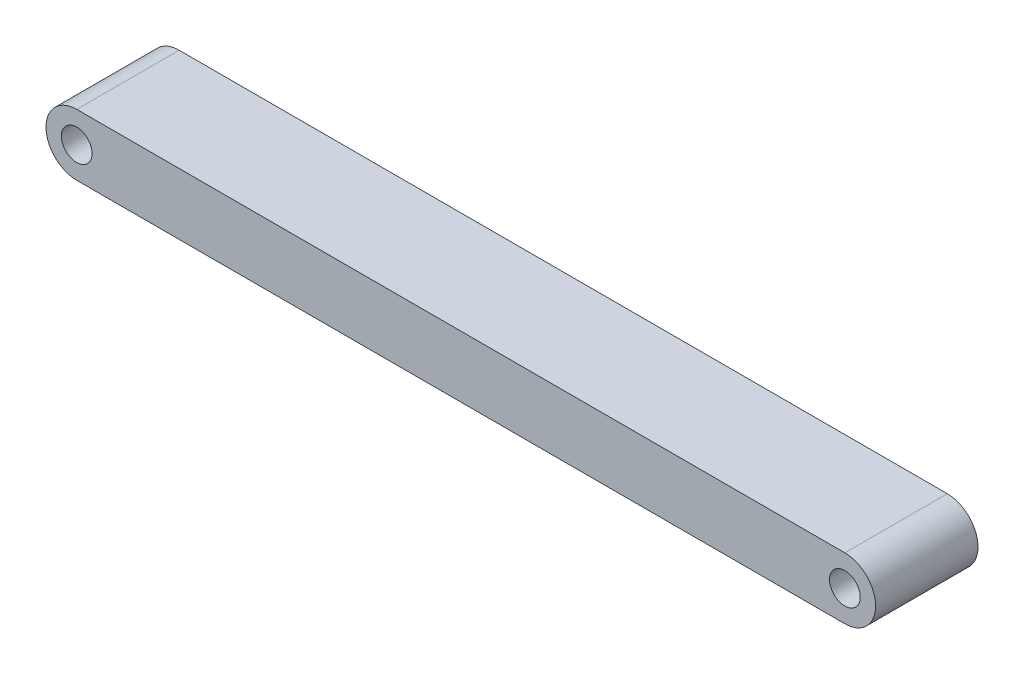
ISO-10303-21;
HEADER;
FILE_DESCRIPTION(('STEP AP214'),'2;1');
FILE_NAME('part.step','',(''),(''),'','','');
FILE_SCHEMA(('AUTOMOTIVE_DESIGN { 1 0 10303 214 1 1 1 1 }'));
ENDSEC;
DATA;
#1=APPLICATION_CONTEXT('core data for automotive mechanical design processes');
#2=APPLICATION_PROTOCOL_DEFINITION('international standard','automotive_design',2000,#1);
#3=PRODUCT_CONTEXT('',#1,'mechanical');
#4=PRODUCT('Part','Part','',(#3));
#5=PRODUCT_RELATED_PRODUCT_CATEGORY('part','',(#4));
#6=PRODUCT_DEFINITION_FORMATION('','',#4);
#7=PRODUCT_DEFINITION_CONTEXT('part definition',#1,'design');
#8=PRODUCT_DEFINITION('design','',#6,#7);
#9=PRODUCT_DEFINITION_SHAPE('','',#8);
#10=(LENGTH_UNIT() NAMED_UNIT(*) SI_UNIT(.MILLI.,.METRE.));
#11=(NAMED_UNIT(*) PLANE_ANGLE_UNIT() SI_UNIT($,.RADIAN.));
#12=(NAMED_UNIT(*) SI_UNIT($,.STERADIAN.) SOLID_ANGLE_UNIT());
#13=UNCERTAINTY_MEASURE_WITH_UNIT(LENGTH_MEASURE(1.E-05),#10,'distance_accuracy_value','');
#14=(GEOMETRIC_REPRESENTATION_CONTEXT(3) GLOBAL_UNCERTAINTY_ASSIGNED_CONTEXT((#13)) GLOBAL_UNIT_ASSIGNED_CONTEXT((#10,
#11,#12)) REPRESENTATION_CONTEXT('',''));
#15=CARTESIAN_POINT('',(0.,0.,0.));
#16=DIRECTION('',(0.,0.,1.));
#17=DIRECTION('',(1.,0.,0.));
#18=AXIS2_PLACEMENT_3D('',#15,#16,#17);
#19=CARTESIAN_POINT('',(0.,3.,-10.));
#20=DIRECTION('',(0.,0.,-1.));
#21=DIRECTION('',(1.,0.,0.));
#22=AXIS2_PLACEMENT_3D('',#19,#20,#21);
#23=PLANE('',#22);
#24=CARTESIAN_POINT('',(0.,3.,-10.));
#25=DIRECTION('',(0.,0.,1.));
#26=DIRECTION('',(1.,0.,0.));
#27=AXIS2_PLACEMENT_3D('',#24,#25,#26);
#28=CIRCLE('',#27,1.5);
#29=CARTESIAN_POINT('',(1.5,3.,-10.));
#30=VERTEX_POINT('',#29);
#31=EDGE_CURVE('E103',#30,#30,#28,.T.);
#32=ORIENTED_EDGE('',*,*,#31,.T.);
#33=EDGE_LOOP('',(#32));
#34=FACE_BOUND('',#33,.T.);
#35=CARTESIAN_POINT('',(0.,3.,-10.));
#36=DIRECTION('',(0.,0.,1.));
#37=DIRECTION('',(1.,0.,0.));
#38=AXIS2_PLACEMENT_3D('',#35,#36,#37);
#39=CIRCLE('',#38,3.);
#40=CARTESIAN_POINT('',(0.,6.,-10.));
#41=VERTEX_POINT('',#40);
#42=CARTESIAN_POINT('',(0.,0.,-10.));
#43=VERTEX_POINT('',#42);
#44=EDGE_CURVE('E91',#41,#43,#39,.T.);
#45=ORIENTED_EDGE('',*,*,#44,.F.);
#46=DIRECTION('',(-1.,0.,0.));
#47=VECTOR('',#46,1.);
#48=CARTESIAN_POINT('',(0.,6.,-10.));
#49=LINE('',#48,#47);
#50=CARTESIAN_POINT('',(75.,6.,-10.));
#51=VERTEX_POINT('',#50);
#52=EDGE_CURVE('E94',#51,#41,#49,.T.);
#53=ORIENTED_EDGE('',*,*,#52,.F.);
#54=CARTESIAN_POINT('',(75.,3.,-10.));
#55=DIRECTION('',(0.,0.,1.));
#56=DIRECTION('',(-1.,0.,0.));
#57=AXIS2_PLACEMENT_3D('',#54,#55,#56);
#58=CIRCLE('',#57,3.);
#59=CARTESIAN_POINT('',(75.,0.,-10.));
#60=VERTEX_POINT('',#59);
#61=EDGE_CURVE('E82',#60,#51,#58,.T.);
#62=ORIENTED_EDGE('',*,*,#61,.F.);
#63=DIRECTION('',(1.,0.,0.));
#64=VECTOR('',#63,1.);
#65=CARTESIAN_POINT('',(0.,0.,-10.));
#66=LINE('',#65,#64);
#67=EDGE_CURVE('E87',#43,#60,#66,.T.);
#68=ORIENTED_EDGE('',*,*,#67,.F.);
#69=EDGE_LOOP('',(#45,#53,#62,#68));
#70=FACE_BOUND('',#69,.T.);
#71=CARTESIAN_POINT('',(75.,3.,-10.));
#72=DIRECTION('',(0.,0.,1.));
#73=DIRECTION('',(1.,0.,0.));
#74=AXIS2_PLACEMENT_3D('',#71,#72,#73);
#75=CIRCLE('',#74,1.5);
#76=CARTESIAN_POINT('',(76.5,3.,-10.));
#77=VERTEX_POINT('',#76);
#78=EDGE_CURVE('E114',#77,#77,#75,.T.);
#79=ORIENTED_EDGE('',*,*,#78,.T.);
#80=EDGE_LOOP('',(#79));
#81=FACE_BOUND('',#80,.T.);
#82=ADVANCED_FACE('F35',(#34,#70,#81),#23,.T.);
#83=CARTESIAN_POINT('',(0.,3.,0.));
#84=DIRECTION('',(0.,0.,-1.));
#85=DIRECTION('',(1.,0.,0.));
#86=AXIS2_PLACEMENT_3D('',#83,#84,#85);
#87=PLANE('',#86);
#88=CARTESIAN_POINT('',(0.,3.,0.));
#89=DIRECTION('',(0.,0.,1.));
#90=DIRECTION('',(1.,0.,0.));
#91=AXIS2_PLACEMENT_3D('',#88,#89,#90);
#92=CIRCLE('',#91,3.);
#93=CARTESIAN_POINT('',(0.,6.,0.));
#94=VERTEX_POINT('',#93);
#95=CARTESIAN_POINT('',(0.,0.,0.));
#96=VERTEX_POINT('',#95);
#97=EDGE_CURVE('E99',#94,#96,#92,.T.);
#98=ORIENTED_EDGE('',*,*,#97,.T.);
#99=DIRECTION('',(1.,0.,0.));
#100=VECTOR('',#99,1.);
#101=CARTESIAN_POINT('',(0.,0.,0.));
#102=LINE('',#101,#100);
#103=CARTESIAN_POINT('',(75.,0.,0.));
#104=VERTEX_POINT('',#103);
#105=EDGE_CURVE('E102',#96,#104,#102,.T.);
#106=ORIENTED_EDGE('',*,*,#105,.T.);
#107=CARTESIAN_POINT('',(75.,3.,0.));
#108=DIRECTION('',(0.,0.,1.));
#109=DIRECTION('',(-1.,0.,0.));
#110=AXIS2_PLACEMENT_3D('',#107,#108,#109);
#111=CIRCLE('',#110,3.);
#112=CARTESIAN_POINT('',(75.,6.,0.));
#113=VERTEX_POINT('',#112);
#114=EDGE_CURVE('E85',#104,#113,#111,.T.);
#115=ORIENTED_EDGE('',*,*,#114,.T.);
#116=DIRECTION('',(-1.,0.,0.));
#117=VECTOR('',#116,1.);
#118=CARTESIAN_POINT('',(0.,6.,0.));
#119=LINE('',#118,#117);
#120=EDGE_CURVE('E106',#113,#94,#119,.T.);
#121=ORIENTED_EDGE('',*,*,#120,.T.);
#122=EDGE_LOOP('',(#98,#106,#115,#121));
#123=FACE_BOUND('',#122,.T.);
#124=CARTESIAN_POINT('',(0.,3.,0.));
#125=DIRECTION('',(0.,0.,1.));
#126=DIRECTION('',(1.,0.,0.));
#127=AXIS2_PLACEMENT_3D('',#124,#125,#126);
#128=CIRCLE('',#127,1.5);
#129=CARTESIAN_POINT('',(1.5,3.,0.));
#130=VERTEX_POINT('',#129);
#131=EDGE_CURVE('E111',#130,#130,#128,.T.);
#132=ORIENTED_EDGE('',*,*,#131,.F.);
#133=EDGE_LOOP('',(#132));
#134=FACE_BOUND('',#133,.T.);
#135=CARTESIAN_POINT('',(75.,3.,0.));
#136=DIRECTION('',(0.,0.,1.));
#137=DIRECTION('',(1.,0.,0.));
#138=AXIS2_PLACEMENT_3D('',#135,#136,#137);
#139=CIRCLE('',#138,1.5);
#140=CARTESIAN_POINT('',(76.5,3.,0.));
#141=VERTEX_POINT('',#140);
#142=EDGE_CURVE('E117',#141,#141,#139,.T.);
#143=ORIENTED_EDGE('',*,*,#142,.F.);
#144=EDGE_LOOP('',(#143));
#145=FACE_BOUND('',#144,.T.);
#146=ADVANCED_FACE('F130',(#123,#134,#145),#87,.F.);
#147=CARTESIAN_POINT('',(0.,3.,-10.));
#148=DIRECTION('',(0.,0.,1.));
#149=DIRECTION('',(-1.,0.,0.));
#150=AXIS2_PLACEMENT_3D('',#147,#148,#149);
#151=CYLINDRICAL_SURFACE('',#150,3.);
#152=ORIENTED_EDGE('',*,*,#97,.F.);
#153=DIRECTION('',(0.,0.,1.));
#154=VECTOR('',#153,1.);
#155=CARTESIAN_POINT('',(0.,6.,-10.));
#156=LINE('',#155,#154);
#157=EDGE_CURVE('E52',#41,#94,#156,.T.);
#158=ORIENTED_EDGE('',*,*,#157,.F.);
#159=ORIENTED_EDGE('',*,*,#44,.T.);
#160=DIRECTION('',(0.,0.,1.));
#161=VECTOR('',#160,1.);
#162=CARTESIAN_POINT('',(0.,0.,-10.));
#163=LINE('',#162,#161);
#164=EDGE_CURVE('E11',#43,#96,#163,.T.);
#165=ORIENTED_EDGE('',*,*,#164,.T.);
#166=EDGE_LOOP('',(#152,#158,#159,#165));
#167=FACE_BOUND('',#166,.T.);
#168=ADVANCED_FACE('F37',(#167),#151,.T.);
#169=CARTESIAN_POINT('',(0.,0.,-10.));
#170=DIRECTION('',(0.,1.,0.));
#171=DIRECTION('',(0.,0.,-1.));
#172=AXIS2_PLACEMENT_3D('',#169,#170,#171);
#173=PLANE('',#172);
#174=ORIENTED_EDGE('',*,*,#105,.F.);
#175=ORIENTED_EDGE('',*,*,#164,.F.);
#176=ORIENTED_EDGE('',*,*,#67,.T.);
#177=DIRECTION('',(0.,0.,1.));
#178=VECTOR('',#177,1.);
#179=CARTESIAN_POINT('',(75.,0.,-10.));
#180=LINE('',#179,#178);
#181=EDGE_CURVE('E44',#60,#104,#180,.T.);
#182=ORIENTED_EDGE('',*,*,#181,.T.);
#183=EDGE_LOOP('',(#174,#175,#176,#182));
#184=FACE_BOUND('',#183,.T.);
#185=ADVANCED_FACE('F88',(#184),#173,.F.);
#186=CARTESIAN_POINT('',(75.,3.,-10.));
#187=DIRECTION('',(0.,0.,1.));
#188=DIRECTION('',(-1.,0.,0.));
#189=AXIS2_PLACEMENT_3D('',#186,#187,#188);
#190=CYLINDRICAL_SURFACE('',#189,3.);
#191=ORIENTED_EDGE('',*,*,#114,.F.);
#192=ORIENTED_EDGE('',*,*,#181,.F.);
#193=ORIENTED_EDGE('',*,*,#61,.T.);
#194=DIRECTION('',(0.,0.,1.));
#195=VECTOR('',#194,1.);
#196=CARTESIAN_POINT('',(75.,6.,-10.));
#197=LINE('',#196,#195);
#198=EDGE_CURVE('E68',#51,#113,#197,.T.);
#199=ORIENTED_EDGE('',*,*,#198,.T.);
#200=EDGE_LOOP('',(#191,#192,#193,#199));
#201=FACE_BOUND('',#200,.T.);
#202=ADVANCED_FACE('F80',(#201),#190,.T.);
#203=CARTESIAN_POINT('',(0.,6.,-10.));
#204=DIRECTION('',(0.,-1.,0.));
#205=DIRECTION('',(1.,0.,0.));
#206=AXIS2_PLACEMENT_3D('',#203,#204,#205);
#207=PLANE('',#206);
#208=ORIENTED_EDGE('',*,*,#120,.F.);
#209=ORIENTED_EDGE('',*,*,#198,.F.);
#210=ORIENTED_EDGE('',*,*,#52,.T.);
#211=ORIENTED_EDGE('',*,*,#157,.T.);
#212=EDGE_LOOP('',(#208,#209,#210,#211));
#213=FACE_BOUND('',#212,.T.);
#214=ADVANCED_FACE('F142',(#213),#207,.F.);
#215=CARTESIAN_POINT('',(0.,3.,-10.));
#216=DIRECTION('',(0.,0.,1.));
#217=DIRECTION('',(-1.,0.,0.));
#218=AXIS2_PLACEMENT_3D('',#215,#216,#217);
#219=CYLINDRICAL_SURFACE('',#218,1.5);
#220=ORIENTED_EDGE('',*,*,#31,.F.);
#221=EDGE_LOOP('',(#220));
#222=FACE_BOUND('',#221,.T.);
#223=ORIENTED_EDGE('',*,*,#131,.T.);
#224=EDGE_LOOP('',(#223));
#225=FACE_BOUND('',#224,.T.);
#226=ADVANCED_FACE('F126',(#222,#225),#219,.F.);
#227=CARTESIAN_POINT('',(75.,3.,-10.));
#228=DIRECTION('',(0.,0.,1.));
#229=DIRECTION('',(-1.,0.,0.));
#230=AXIS2_PLACEMENT_3D('',#227,#228,#229);
#231=CYLINDRICAL_SURFACE('',#230,1.5);
#232=ORIENTED_EDGE('',*,*,#78,.F.);
#233=EDGE_LOOP('',(#232));
#234=FACE_BOUND('',#233,.T.);
#235=ORIENTED_EDGE('',*,*,#142,.T.);
#236=EDGE_LOOP('',(#235));
#237=FACE_BOUND('',#236,.T.);
#238=ADVANCED_FACE('F123',(#234,#237),#231,.F.);
#239=CLOSED_SHELL('',(#82,#146,#168,#185,#202,#214,#226,#238));
#240=MANIFOLD_SOLID_BREP('B2',#239);
#241=ADVANCED_BREP_SHAPE_REPRESENTATION('',(#18,#240),#14);
#242=SHAPE_DEFINITION_REPRESENTATION(#9,#241);
ENDSEC;
END-ISO-10303-21;
